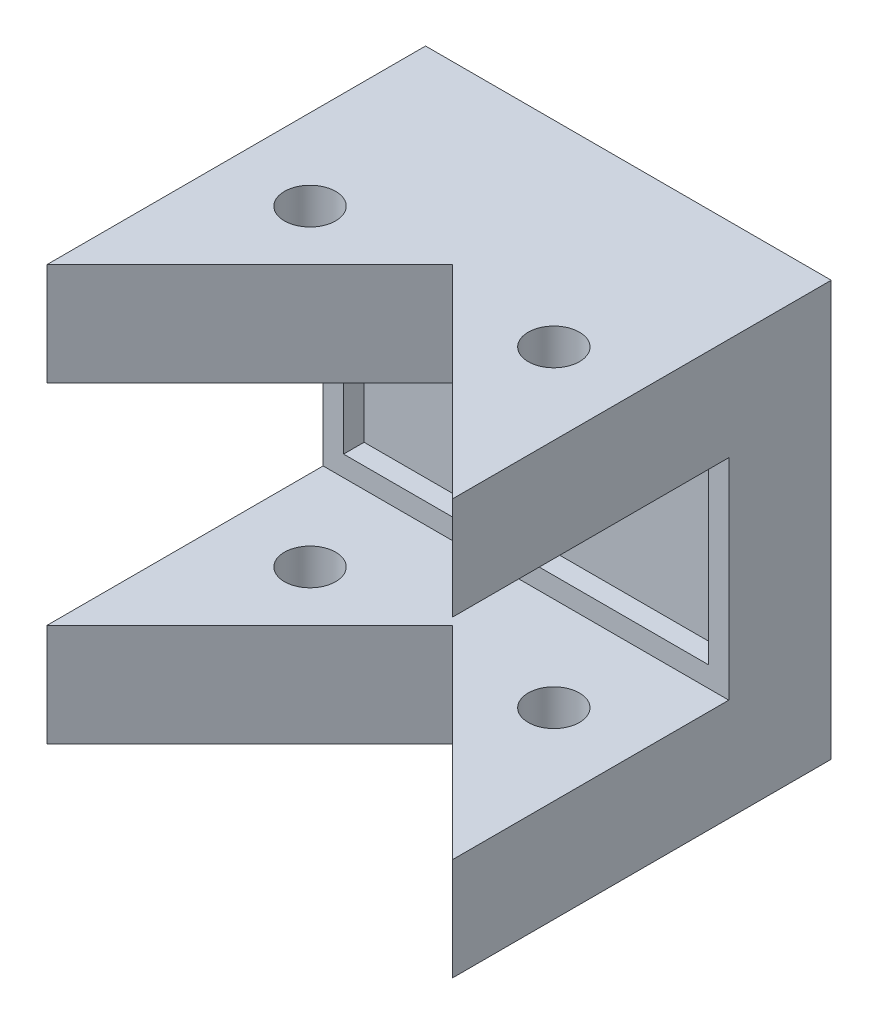
ISO-10303-21;
HEADER;
FILE_DESCRIPTION(('STEP AP214'),'2;1');
FILE_NAME('part.step','',(''),(''),'','','');
FILE_SCHEMA(('AUTOMOTIVE_DESIGN { 1 0 10303 214 1 1 1 1 }'));
ENDSEC;
DATA;
#1=APPLICATION_CONTEXT('core data for automotive mechanical design processes');
#2=APPLICATION_PROTOCOL_DEFINITION('international standard','automotive_design',2000,#1);
#3=PRODUCT_CONTEXT('',#1,'mechanical');
#4=PRODUCT('Part','Part','',(#3));
#5=PRODUCT_RELATED_PRODUCT_CATEGORY('part','',(#4));
#6=PRODUCT_DEFINITION_FORMATION('','',#4);
#7=PRODUCT_DEFINITION_CONTEXT('part definition',#1,'design');
#8=PRODUCT_DEFINITION('design','',#6,#7);
#9=PRODUCT_DEFINITION_SHAPE('','',#8);
#10=(LENGTH_UNIT() NAMED_UNIT(*) SI_UNIT(.MILLI.,.METRE.));
#11=(NAMED_UNIT(*) PLANE_ANGLE_UNIT() SI_UNIT($,.RADIAN.));
#12=(NAMED_UNIT(*) SI_UNIT($,.STERADIAN.) SOLID_ANGLE_UNIT());
#13=UNCERTAINTY_MEASURE_WITH_UNIT(LENGTH_MEASURE(1.E-05),#10,'distance_accuracy_value','');
#14=(GEOMETRIC_REPRESENTATION_CONTEXT(3) GLOBAL_UNCERTAINTY_ASSIGNED_CONTEXT((#13)) GLOBAL_UNIT_ASSIGNED_CONTEXT((#10,
#11,#12)) REPRESENTATION_CONTEXT('',''));
#15=CARTESIAN_POINT('',(0.,0.,0.));
#16=DIRECTION('',(0.,0.,1.));
#17=DIRECTION('',(1.,0.,0.));
#18=AXIS2_PLACEMENT_3D('',#15,#16,#17);
#19=CARTESIAN_POINT('',(0.,0.,5.));
#20=DIRECTION('',(0.,0.,-1.));
#21=DIRECTION('',(-1.,0.,0.));
#22=AXIS2_PLACEMENT_3D('',#19,#20,#21);
#23=PLANE('',#22);
#24=DIRECTION('',(1.,0.,0.));
#25=VECTOR('',#24,1.);
#26=CARTESIAN_POINT('',(2.,6.75,5.));
#27=LINE('',#26,#25);
#28=CARTESIAN_POINT('',(2.,6.75,5.));
#29=VERTEX_POINT('',#28);
#30=CARTESIAN_POINT('',(37.6,6.75,5.));
#31=VERTEX_POINT('',#30);
#32=EDGE_CURVE('E183',#29,#31,#27,.T.);
#33=ORIENTED_EDGE('',*,*,#32,.F.);
#34=DIRECTION('',(0.,-1.,0.));
#35=VECTOR('',#34,1.);
#36=CARTESIAN_POINT('',(2.,23.25,5.));
#37=LINE('',#36,#35);
#38=CARTESIAN_POINT('',(2.,23.25,5.));
#39=VERTEX_POINT('',#38);
#40=EDGE_CURVE('E59',#39,#29,#37,.T.);
#41=ORIENTED_EDGE('',*,*,#40,.F.);
#42=DIRECTION('',(-1.,0.,0.));
#43=VECTOR('',#42,1.);
#44=CARTESIAN_POINT('',(2.,23.25,5.));
#45=LINE('',#44,#43);
#46=CARTESIAN_POINT('',(37.6,23.25,5.));
#47=VERTEX_POINT('',#46);
#48=EDGE_CURVE('E167',#47,#39,#45,.T.);
#49=ORIENTED_EDGE('',*,*,#48,.F.);
#50=DIRECTION('',(0.,1.,0.));
#51=VECTOR('',#50,1.);
#52=CARTESIAN_POINT('',(37.6,23.25,5.));
#53=LINE('',#52,#51);
#54=EDGE_CURVE('E171',#31,#47,#53,.T.);
#55=ORIENTED_EDGE('',*,*,#54,.F.);
#56=EDGE_LOOP('',(#33,#41,#49,#55));
#57=FACE_BOUND('',#56,.T.);
#58=DIRECTION('',(-1.,0.,0.));
#59=VECTOR('',#58,1.);
#60=CARTESIAN_POINT('',(39.6,25.25,5.));
#61=LINE('',#60,#59);
#62=CARTESIAN_POINT('',(39.6,25.25,5.));
#63=VERTEX_POINT('',#62);
#64=CARTESIAN_POINT('',(0.,25.25,5.));
#65=VERTEX_POINT('',#64);
#66=EDGE_CURVE('E66',#63,#65,#61,.T.);
#67=ORIENTED_EDGE('',*,*,#66,.T.);
#68=DIRECTION('',(0.,-1.,0.));
#69=VECTOR('',#68,1.);
#70=CARTESIAN_POINT('',(0.,0.,5.));
#71=LINE('',#70,#69);
#72=CARTESIAN_POINT('',(0.,4.75,5.));
#73=VERTEX_POINT('',#72);
#74=EDGE_CURVE('E51',#65,#73,#71,.T.);
#75=ORIENTED_EDGE('',*,*,#74,.T.);
#76=DIRECTION('',(1.,0.,0.));
#77=VECTOR('',#76,1.);
#78=CARTESIAN_POINT('',(0.,4.75,5.));
#79=LINE('',#78,#77);
#80=CARTESIAN_POINT('',(39.6,4.75,5.));
#81=VERTEX_POINT('',#80);
#82=EDGE_CURVE('E252',#73,#81,#79,.T.);
#83=ORIENTED_EDGE('',*,*,#82,.T.);
#84=DIRECTION('',(0.,1.,0.));
#85=VECTOR('',#84,1.);
#86=CARTESIAN_POINT('',(39.6,0.,5.));
#87=LINE('',#86,#85);
#88=EDGE_CURVE('E11',#81,#63,#87,.T.);
#89=ORIENTED_EDGE('',*,*,#88,.T.);
#90=EDGE_LOOP('',(#67,#75,#83,#89));
#91=FACE_BOUND('',#90,.T.);
#92=ADVANCED_FACE('F41',(#57,#91),#23,.F.);
#93=CARTESIAN_POINT('',(0.,0.,5.));
#94=DIRECTION('',(1.,0.,0.));
#95=DIRECTION('',(0.,0.,-1.));
#96=AXIS2_PLACEMENT_3D('',#93,#94,#95);
#97=PLANE('',#96);
#98=DIRECTION('',(0.,0.,1.));
#99=VECTOR('',#98,1.);
#100=CARTESIAN_POINT('',(0.,35.25,5.));
#101=LINE('',#100,#99);
#102=CARTESIAN_POINT('',(0.,35.25,-5.));
#103=VERTEX_POINT('',#102);
#104=CARTESIAN_POINT('',(0.,35.25,31.975));
#105=VERTEX_POINT('',#104);
#106=EDGE_CURVE('E231',#103,#105,#101,.T.);
#107=ORIENTED_EDGE('',*,*,#106,.F.);
#108=DIRECTION('',(0.,1.,0.));
#109=VECTOR('',#108,1.);
#110=CARTESIAN_POINT('',(0.,35.25,-5.));
#111=LINE('',#110,#109);
#112=CARTESIAN_POINT('',(0.,-5.25,-5.));
#113=VERTEX_POINT('',#112);
#114=EDGE_CURVE('E205',#113,#103,#111,.T.);
#115=ORIENTED_EDGE('',*,*,#114,.F.);
#116=DIRECTION('',(0.,0.,-1.));
#117=VECTOR('',#116,1.);
#118=CARTESIAN_POINT('',(0.,-5.25,5.));
#119=LINE('',#118,#117);
#120=CARTESIAN_POINT('',(0.,-5.25,31.975));
#121=VERTEX_POINT('',#120);
#122=EDGE_CURVE('E281',#121,#113,#119,.T.);
#123=ORIENTED_EDGE('',*,*,#122,.F.);
#124=DIRECTION('',(0.,1.,0.));
#125=VECTOR('',#124,1.);
#126=CARTESIAN_POINT('',(0.,-5.25,31.975));
#127=LINE('',#126,#125);
#128=CARTESIAN_POINT('',(0.,4.75,31.975));
#129=VERTEX_POINT('',#128);
#130=EDGE_CURVE('E284',#121,#129,#127,.T.);
#131=ORIENTED_EDGE('',*,*,#130,.T.);
#132=DIRECTION('',(0.,0.,-1.));
#133=VECTOR('',#132,1.);
#134=CARTESIAN_POINT('',(0.,4.75,5.));
#135=LINE('',#134,#133);
#136=EDGE_CURVE('E268',#129,#73,#135,.T.);
#137=ORIENTED_EDGE('',*,*,#136,.T.);
#138=ORIENTED_EDGE('',*,*,#74,.F.);
#139=DIRECTION('',(0.,0.,1.));
#140=VECTOR('',#139,1.);
#141=CARTESIAN_POINT('',(0.,25.25,5.));
#142=LINE('',#141,#140);
#143=CARTESIAN_POINT('',(0.,25.25,31.975));
#144=VERTEX_POINT('',#143);
#145=EDGE_CURVE('E215',#65,#144,#142,.T.);
#146=ORIENTED_EDGE('',*,*,#145,.T.);
#147=DIRECTION('',(0.,-1.,0.));
#148=VECTOR('',#147,1.);
#149=CARTESIAN_POINT('',(0.,35.25,31.975));
#150=LINE('',#149,#148);
#151=EDGE_CURVE('E249',#105,#144,#150,.T.);
#152=ORIENTED_EDGE('',*,*,#151,.F.);
#153=EDGE_LOOP('',(#107,#115,#123,#131,#137,#138,#146,#152));
#154=FACE_BOUND('',#153,.T.);
#155=ADVANCED_FACE('F43',(#154),#97,.F.);
#156=CARTESIAN_POINT('',(39.6,0.,5.));
#157=DIRECTION('',(-1.,0.,0.));
#158=DIRECTION('',(0.,0.,1.));
#159=AXIS2_PLACEMENT_3D('',#156,#157,#158);
#160=PLANE('',#159);
#161=DIRECTION('',(0.,0.,1.));
#162=VECTOR('',#161,1.);
#163=CARTESIAN_POINT('',(39.6000000000001,-5.25,31.9770202535535));
#164=LINE('',#163,#162);
#165=CARTESIAN_POINT('',(39.6,-5.25,-5.));
#166=VERTEX_POINT('',#165);
#167=CARTESIAN_POINT('',(39.6000000000001,-5.25,31.9770202535535));
#168=VERTEX_POINT('',#167);
#169=EDGE_CURVE('E272',#166,#168,#164,.T.);
#170=ORIENTED_EDGE('',*,*,#169,.F.);
#171=DIRECTION('',(0.,-1.,0.));
#172=VECTOR('',#171,1.);
#173=CARTESIAN_POINT('',(39.6,35.25,-5.));
#174=LINE('',#173,#172);
#175=CARTESIAN_POINT('',(39.6,35.25,-5.));
#176=VERTEX_POINT('',#175);
#177=EDGE_CURVE('E192',#176,#166,#174,.T.);
#178=ORIENTED_EDGE('',*,*,#177,.F.);
#179=DIRECTION('',(0.,0.,-1.));
#180=VECTOR('',#179,1.);
#181=CARTESIAN_POINT('',(39.6000000000001,35.25,31.9770202535535));
#182=LINE('',#181,#180);
#183=CARTESIAN_POINT('',(39.6000000000001,35.25,31.9770202535535));
#184=VERTEX_POINT('',#183);
#185=EDGE_CURVE('E240',#184,#176,#182,.T.);
#186=ORIENTED_EDGE('',*,*,#185,.F.);
#187=DIRECTION('',(0.,-1.,0.));
#188=VECTOR('',#187,1.);
#189=CARTESIAN_POINT('',(39.6000000000001,35.25,31.9770202535535));
#190=LINE('',#189,#188);
#191=CARTESIAN_POINT('',(39.6000000000001,25.25,31.9770202535535));
#192=VERTEX_POINT('',#191);
#193=EDGE_CURVE('E243',#184,#192,#190,.T.);
#194=ORIENTED_EDGE('',*,*,#193,.T.);
#195=DIRECTION('',(0.,0.,-1.));
#196=VECTOR('',#195,1.);
#197=CARTESIAN_POINT('',(39.6000000000001,25.25,31.9770202535535));
#198=LINE('',#197,#196);
#199=EDGE_CURVE('E227',#192,#63,#198,.T.);
#200=ORIENTED_EDGE('',*,*,#199,.T.);
#201=ORIENTED_EDGE('',*,*,#88,.F.);
#202=DIRECTION('',(0.,0.,1.));
#203=VECTOR('',#202,1.);
#204=CARTESIAN_POINT('',(39.6000000000001,4.75,31.9770202535535));
#205=LINE('',#204,#203);
#206=CARTESIAN_POINT('',(39.6000000000001,4.75,31.9770202535535));
#207=VERTEX_POINT('',#206);
#208=EDGE_CURVE('E256',#81,#207,#205,.T.);
#209=ORIENTED_EDGE('',*,*,#208,.T.);
#210=DIRECTION('',(0.,1.,0.));
#211=VECTOR('',#210,1.);
#212=CARTESIAN_POINT('',(39.6000000000001,-5.25,31.9770202535535));
#213=LINE('',#212,#211);
#214=EDGE_CURVE('E290',#168,#207,#213,.T.);
#215=ORIENTED_EDGE('',*,*,#214,.F.);
#216=EDGE_LOOP('',(#170,#178,#186,#194,#200,#201,#209,#215));
#217=FACE_BOUND('',#216,.T.);
#218=ADVANCED_FACE('F348',(#217),#160,.F.);
#219=CARTESIAN_POINT('',(19.7989898732233,-5.25,12.1760101267767));
#220=DIRECTION('',(0.707106781186548,0.,-0.707106781186547));
#221=DIRECTION('',(-0.707106781186547,0.,-0.707106781186548));
#222=AXIS2_PLACEMENT_3D('',#219,#220,#221);
#223=PLANE('',#222);
#224=ORIENTED_EDGE('',*,*,#214,.T.);
#225=DIRECTION('',(-0.707106781186547,0.,-0.707106781186548));
#226=VECTOR('',#225,1.);
#227=CARTESIAN_POINT('',(19.7989898732233,4.75,12.1760101267767));
#228=LINE('',#227,#226);
#229=CARTESIAN_POINT('',(19.7989898732233,4.75,12.1760101267767));
#230=VERTEX_POINT('',#229);
#231=EDGE_CURVE('E260',#207,#230,#228,.T.);
#232=ORIENTED_EDGE('',*,*,#231,.T.);
#233=DIRECTION('',(0.,1.,0.));
#234=VECTOR('',#233,1.);
#235=CARTESIAN_POINT('',(19.7989898732233,-5.25,12.1760101267767));
#236=LINE('',#235,#234);
#237=CARTESIAN_POINT('',(19.7989898732233,-5.25,12.1760101267767));
#238=VERTEX_POINT('',#237);
#239=EDGE_CURVE('E287',#238,#230,#236,.T.);
#240=ORIENTED_EDGE('',*,*,#239,.F.);
#241=DIRECTION('',(-0.707106781186547,0.,-0.707106781186548));
#242=VECTOR('',#241,1.);
#243=CARTESIAN_POINT('',(19.7989898732233,-5.25,12.1760101267767));
#244=LINE('',#243,#242);
#245=EDGE_CURVE('E275',#168,#238,#244,.T.);
#246=ORIENTED_EDGE('',*,*,#245,.F.);
#247=EDGE_LOOP('',(#224,#232,#240,#246));
#248=FACE_BOUND('',#247,.T.);
#249=ADVANCED_FACE('F351',(#248),#223,.F.);
#250=CARTESIAN_POINT('',(0.,-5.25,31.975));
#251=DIRECTION('',(-0.707106781186547,0.,-0.707106781186548));
#252=DIRECTION('',(-0.707106781186548,0.,0.707106781186547));
#253=AXIS2_PLACEMENT_3D('',#250,#251,#252);
#254=PLANE('',#253);
#255=ORIENTED_EDGE('',*,*,#239,.T.);
#256=DIRECTION('',(-0.707106781186548,0.,0.707106781186547));
#257=VECTOR('',#256,1.);
#258=CARTESIAN_POINT('',(0.,4.75,31.975));
#259=LINE('',#258,#257);
#260=EDGE_CURVE('E264',#230,#129,#259,.T.);
#261=ORIENTED_EDGE('',*,*,#260,.T.);
#262=ORIENTED_EDGE('',*,*,#130,.F.);
#263=DIRECTION('',(-0.707106781186548,0.,0.707106781186547));
#264=VECTOR('',#263,1.);
#265=CARTESIAN_POINT('',(0.,-5.25,31.975));
#266=LINE('',#265,#264);
#267=EDGE_CURVE('E278',#238,#121,#266,.T.);
#268=ORIENTED_EDGE('',*,*,#267,.F.);
#269=EDGE_LOOP('',(#255,#261,#262,#268));
#270=FACE_BOUND('',#269,.T.);
#271=ADVANCED_FACE('F358',(#270),#254,.F.);
#272=CARTESIAN_POINT('',(0.,-5.25,0.));
#273=DIRECTION('',(0.,1.,0.));
#274=DIRECTION('',(0.,0.,1.));
#275=AXIS2_PLACEMENT_3D('',#272,#273,#274);
#276=PLANE('',#275);
#277=CARTESIAN_POINT('',(31.7,-5.25,14.1775253169417));
#278=DIRECTION('',(0.,-1.,0.));
#279=DIRECTION('',(0.,0.,-1.));
#280=AXIS2_PLACEMENT_3D('',#277,#278,#279);
#281=CIRCLE('',#280,2.49999999999999);
#282=CARTESIAN_POINT('',(31.7,-5.25,11.6775253169417));
#283=VERTEX_POINT('',#282);
#284=EDGE_CURVE('E317',#283,#283,#281,.T.);
#285=ORIENTED_EDGE('',*,*,#284,.F.);
#286=EDGE_LOOP('',(#285));
#287=FACE_BOUND('',#286,.T.);
#288=CARTESIAN_POINT('',(7.9,-5.25,14.1755050633883));
#289=DIRECTION('',(0.,-1.,0.));
#290=DIRECTION('',(0.,0.,-1.));
#291=AXIS2_PLACEMENT_3D('',#288,#289,#290);
#292=CIRCLE('',#291,2.5);
#293=CARTESIAN_POINT('',(7.9,-5.25,11.6755050633883));
#294=VERTEX_POINT('',#293);
#295=EDGE_CURVE('E298',#294,#294,#292,.T.);
#296=ORIENTED_EDGE('',*,*,#295,.F.);
#297=EDGE_LOOP('',(#296));
#298=FACE_BOUND('',#297,.T.);
#299=ORIENTED_EDGE('',*,*,#122,.T.);
#300=DIRECTION('',(-1.,0.,0.));
#301=VECTOR('',#300,1.);
#302=CARTESIAN_POINT('',(39.6,-5.25,-5.));
#303=LINE('',#302,#301);
#304=EDGE_CURVE('E201',#166,#113,#303,.T.);
#305=ORIENTED_EDGE('',*,*,#304,.F.);
#306=ORIENTED_EDGE('',*,*,#169,.T.);
#307=ORIENTED_EDGE('',*,*,#245,.T.);
#308=ORIENTED_EDGE('',*,*,#267,.T.);
#309=EDGE_LOOP('',(#299,#305,#306,#307,#308));
#310=FACE_BOUND('',#309,.T.);
#311=ADVANCED_FACE('F366',(#287,#298,#310),#276,.F.);
#312=CARTESIAN_POINT('',(0.,4.75,0.));
#313=DIRECTION('',(0.,1.,0.));
#314=DIRECTION('',(0.,0.,1.));
#315=AXIS2_PLACEMENT_3D('',#312,#313,#314);
#316=PLANE('',#315);
#317=CARTESIAN_POINT('',(31.7,4.75,14.1775253169417));
#318=DIRECTION('',(0.,1.,0.));
#319=DIRECTION('',(0.,0.,1.));
#320=AXIS2_PLACEMENT_3D('',#317,#318,#319);
#321=CIRCLE('',#320,2.49999999999999);
#322=CARTESIAN_POINT('',(31.7,4.74999999999999,11.6775253169417));
#323=VERTEX_POINT('',#322);
#324=EDGE_CURVE('E305',#323,#323,#321,.T.);
#325=ORIENTED_EDGE('',*,*,#324,.F.);
#326=EDGE_LOOP('',(#325));
#327=FACE_BOUND('',#326,.T.);
#328=CARTESIAN_POINT('',(7.9,4.75,14.1755050633883));
#329=DIRECTION('',(0.,1.,0.));
#330=DIRECTION('',(0.,0.,1.));
#331=AXIS2_PLACEMENT_3D('',#328,#329,#330);
#332=CIRCLE('',#331,2.5);
#333=CARTESIAN_POINT('',(7.9,4.74999999999999,11.6755050633883));
#334=VERTEX_POINT('',#333);
#335=EDGE_CURVE('E174',#334,#334,#332,.T.);
#336=ORIENTED_EDGE('',*,*,#335,.F.);
#337=EDGE_LOOP('',(#336));
#338=FACE_BOUND('',#337,.T.);
#339=ORIENTED_EDGE('',*,*,#82,.F.);
#340=ORIENTED_EDGE('',*,*,#136,.F.);
#341=ORIENTED_EDGE('',*,*,#260,.F.);
#342=ORIENTED_EDGE('',*,*,#231,.F.);
#343=ORIENTED_EDGE('',*,*,#208,.F.);
#344=EDGE_LOOP('',(#339,#340,#341,#342,#343));
#345=FACE_BOUND('',#344,.T.);
#346=ADVANCED_FACE('F390',(#327,#338,#345),#316,.T.);
#347=CARTESIAN_POINT('',(0.,35.25,31.975));
#348=DIRECTION('',(-0.707106781186547,0.,-0.707106781186548));
#349=DIRECTION('',(-0.707106781186548,0.,0.707106781186547));
#350=AXIS2_PLACEMENT_3D('',#347,#348,#349);
#351=PLANE('',#350);
#352=ORIENTED_EDGE('',*,*,#151,.T.);
#353=DIRECTION('',(0.707106781186548,0.,-0.707106781186547));
#354=VECTOR('',#353,1.);
#355=CARTESIAN_POINT('',(0.,25.25,31.975));
#356=LINE('',#355,#354);
#357=CARTESIAN_POINT('',(19.7989898732233,25.25,12.1760101267767));
#358=VERTEX_POINT('',#357);
#359=EDGE_CURVE('E219',#144,#358,#356,.T.);
#360=ORIENTED_EDGE('',*,*,#359,.T.);
#361=DIRECTION('',(0.,-1.,0.));
#362=VECTOR('',#361,1.);
#363=CARTESIAN_POINT('',(19.7989898732233,35.25,12.1760101267767));
#364=LINE('',#363,#362);
#365=CARTESIAN_POINT('',(19.7989898732233,35.25,12.1760101267767));
#366=VERTEX_POINT('',#365);
#367=EDGE_CURVE('E246',#366,#358,#364,.T.);
#368=ORIENTED_EDGE('',*,*,#367,.F.);
#369=DIRECTION('',(0.707106781186548,0.,-0.707106781186547));
#370=VECTOR('',#369,1.);
#371=CARTESIAN_POINT('',(0.,35.25,31.975));
#372=LINE('',#371,#370);
#373=EDGE_CURVE('E234',#105,#366,#372,.T.);
#374=ORIENTED_EDGE('',*,*,#373,.F.);
#375=EDGE_LOOP('',(#352,#360,#368,#374));
#376=FACE_BOUND('',#375,.T.);
#377=ADVANCED_FACE('F406',(#376),#351,.F.);
#378=CARTESIAN_POINT('',(19.7989898732233,35.25,12.1760101267767));
#379=DIRECTION('',(0.707106781186548,0.,-0.707106781186547));
#380=DIRECTION('',(-0.707106781186547,0.,-0.707106781186548));
#381=AXIS2_PLACEMENT_3D('',#378,#379,#380);
#382=PLANE('',#381);
#383=ORIENTED_EDGE('',*,*,#367,.T.);
#384=DIRECTION('',(0.707106781186547,0.,0.707106781186548));
#385=VECTOR('',#384,1.);
#386=CARTESIAN_POINT('',(19.7989898732233,25.25,12.1760101267767));
#387=LINE('',#386,#385);
#388=EDGE_CURVE('E223',#358,#192,#387,.T.);
#389=ORIENTED_EDGE('',*,*,#388,.T.);
#390=ORIENTED_EDGE('',*,*,#193,.F.);
#391=DIRECTION('',(0.707106781186547,0.,0.707106781186548));
#392=VECTOR('',#391,1.);
#393=CARTESIAN_POINT('',(19.7989898732233,35.25,12.1760101267767));
#394=LINE('',#393,#392);
#395=EDGE_CURVE('E237',#366,#184,#394,.T.);
#396=ORIENTED_EDGE('',*,*,#395,.F.);
#397=EDGE_LOOP('',(#383,#389,#390,#396));
#398=FACE_BOUND('',#397,.T.);
#399=ADVANCED_FACE('F381',(#398),#382,.F.);
#400=CARTESIAN_POINT('',(0.,35.25,0.));
#401=DIRECTION('',(0.,1.,0.));
#402=DIRECTION('',(0.,0.,1.));
#403=AXIS2_PLACEMENT_3D('',#400,#401,#402);
#404=PLANE('',#403);
#405=CARTESIAN_POINT('',(31.7,35.25,14.1775253169417));
#406=DIRECTION('',(0.,1.,0.));
#407=DIRECTION('',(0.,0.,1.));
#408=AXIS2_PLACEMENT_3D('',#405,#406,#407);
#409=CIRCLE('',#408,2.49999999999999);
#410=CARTESIAN_POINT('',(31.7,35.25,11.6775253169417));
#411=VERTEX_POINT('',#410);
#412=EDGE_CURVE('E311',#411,#411,#409,.T.);
#413=ORIENTED_EDGE('',*,*,#412,.F.);
#414=EDGE_LOOP('',(#413));
#415=FACE_BOUND('',#414,.T.);
#416=CARTESIAN_POINT('',(7.9,35.25,14.1755050633883));
#417=DIRECTION('',(0.,1.,0.));
#418=DIRECTION('',(0.,0.,1.));
#419=AXIS2_PLACEMENT_3D('',#416,#417,#418);
#420=CIRCLE('',#419,2.5);
#421=CARTESIAN_POINT('',(7.9,35.25,11.6755050633883));
#422=VERTEX_POINT('',#421);
#423=EDGE_CURVE('E297',#422,#422,#420,.T.);
#424=ORIENTED_EDGE('',*,*,#423,.F.);
#425=EDGE_LOOP('',(#424));
#426=FACE_BOUND('',#425,.T.);
#427=ORIENTED_EDGE('',*,*,#185,.T.);
#428=DIRECTION('',(1.,0.,0.));
#429=VECTOR('',#428,1.);
#430=CARTESIAN_POINT('',(39.6,35.25,-5.));
#431=LINE('',#430,#429);
#432=EDGE_CURVE('E209',#103,#176,#431,.T.);
#433=ORIENTED_EDGE('',*,*,#432,.F.);
#434=ORIENTED_EDGE('',*,*,#106,.T.);
#435=ORIENTED_EDGE('',*,*,#373,.T.);
#436=ORIENTED_EDGE('',*,*,#395,.T.);
#437=EDGE_LOOP('',(#427,#433,#434,#435,#436));
#438=FACE_BOUND('',#437,.T.);
#439=ADVANCED_FACE('F373',(#415,#426,#438),#404,.T.);
#440=CARTESIAN_POINT('',(0.,25.25,0.));
#441=DIRECTION('',(0.,1.,0.));
#442=DIRECTION('',(0.,0.,1.));
#443=AXIS2_PLACEMENT_3D('',#440,#441,#442);
#444=PLANE('',#443);
#445=CARTESIAN_POINT('',(31.7,25.25,14.1775253169417));
#446=DIRECTION('',(0.,1.,0.));
#447=DIRECTION('',(0.,0.,1.));
#448=AXIS2_PLACEMENT_3D('',#445,#446,#447);
#449=CIRCLE('',#448,2.49999999999999);
#450=CARTESIAN_POINT('',(31.7,25.25,11.6775253169417));
#451=VERTEX_POINT('',#450);
#452=EDGE_CURVE('E45',#451,#451,#449,.T.);
#453=ORIENTED_EDGE('',*,*,#452,.T.);
#454=EDGE_LOOP('',(#453));
#455=FACE_BOUND('',#454,.T.);
#456=CARTESIAN_POINT('',(7.9,25.25,14.1755050633883));
#457=DIRECTION('',(0.,1.,0.));
#458=DIRECTION('',(0.,0.,1.));
#459=AXIS2_PLACEMENT_3D('',#456,#457,#458);
#460=CIRCLE('',#459,2.5);
#461=CARTESIAN_POINT('',(7.9,25.25,11.6755050633883));
#462=VERTEX_POINT('',#461);
#463=EDGE_CURVE('E294',#462,#462,#460,.T.);
#464=ORIENTED_EDGE('',*,*,#463,.T.);
#465=EDGE_LOOP('',(#464));
#466=FACE_BOUND('',#465,.T.);
#467=ORIENTED_EDGE('',*,*,#66,.F.);
#468=ORIENTED_EDGE('',*,*,#199,.F.);
#469=ORIENTED_EDGE('',*,*,#388,.F.);
#470=ORIENTED_EDGE('',*,*,#359,.F.);
#471=ORIENTED_EDGE('',*,*,#145,.F.);
#472=EDGE_LOOP('',(#467,#468,#469,#470,#471));
#473=FACE_BOUND('',#472,.T.);
#474=ADVANCED_FACE('F326',(#455,#466,#473),#444,.F.);
#475=CARTESIAN_POINT('',(0.,0.,-5.));
#476=DIRECTION('',(0.,0.,-1.));
#477=DIRECTION('',(-1.,0.,0.));
#478=AXIS2_PLACEMENT_3D('',#475,#476,#477);
#479=PLANE('',#478);
#480=ORIENTED_EDGE('',*,*,#177,.T.);
#481=ORIENTED_EDGE('',*,*,#304,.T.);
#482=ORIENTED_EDGE('',*,*,#114,.T.);
#483=ORIENTED_EDGE('',*,*,#432,.T.);
#484=EDGE_LOOP('',(#480,#481,#482,#483));
#485=FACE_BOUND('',#484,.T.);
#486=ADVANCED_FACE('F370',(#485),#479,.T.);
#487=CARTESIAN_POINT('',(2.,23.25,3.));
#488=DIRECTION('',(-1.,0.,0.));
#489=DIRECTION('',(0.,-1.,0.));
#490=AXIS2_PLACEMENT_3D('',#487,#488,#489);
#491=PLANE('',#490);
#492=ORIENTED_EDGE('',*,*,#40,.T.);
#493=DIRECTION('',(0.,0.,1.));
#494=VECTOR('',#493,1.);
#495=CARTESIAN_POINT('',(2.,6.75,3.));
#496=LINE('',#495,#494);
#497=CARTESIAN_POINT('',(2.,6.75,3.));
#498=VERTEX_POINT('',#497);
#499=EDGE_CURVE('E142',#498,#29,#496,.T.);
#500=ORIENTED_EDGE('',*,*,#499,.F.);
#501=DIRECTION('',(0.,-1.,0.));
#502=VECTOR('',#501,1.);
#503=CARTESIAN_POINT('',(2.,23.25,3.));
#504=LINE('',#503,#502);
#505=CARTESIAN_POINT('',(2.,23.25,3.));
#506=VERTEX_POINT('',#505);
#507=EDGE_CURVE('E146',#506,#498,#504,.T.);
#508=ORIENTED_EDGE('',*,*,#507,.F.);
#509=DIRECTION('',(0.,0.,1.));
#510=VECTOR('',#509,1.);
#511=CARTESIAN_POINT('',(2.,23.25,3.));
#512=LINE('',#511,#510);
#513=EDGE_CURVE('E189',#506,#39,#512,.T.);
#514=ORIENTED_EDGE('',*,*,#513,.T.);
#515=EDGE_LOOP('',(#492,#500,#508,#514));
#516=FACE_BOUND('',#515,.T.);
#517=ADVANCED_FACE('F144',(#516),#491,.F.);
#518=CARTESIAN_POINT('',(2.,23.25,3.));
#519=DIRECTION('',(0.,1.,0.));
#520=DIRECTION('',(0.,0.,1.));
#521=AXIS2_PLACEMENT_3D('',#518,#519,#520);
#522=PLANE('',#521);
#523=ORIENTED_EDGE('',*,*,#48,.T.);
#524=ORIENTED_EDGE('',*,*,#513,.F.);
#525=DIRECTION('',(-1.,0.,0.));
#526=VECTOR('',#525,1.);
#527=CARTESIAN_POINT('',(2.,23.25,3.));
#528=LINE('',#527,#526);
#529=CARTESIAN_POINT('',(37.6,23.25,3.));
#530=VERTEX_POINT('',#529);
#531=EDGE_CURVE('E153',#530,#506,#528,.T.);
#532=ORIENTED_EDGE('',*,*,#531,.F.);
#533=DIRECTION('',(0.,0.,1.));
#534=VECTOR('',#533,1.);
#535=CARTESIAN_POINT('',(37.6,23.25,3.));
#536=LINE('',#535,#534);
#537=EDGE_CURVE('E193',#530,#47,#536,.T.);
#538=ORIENTED_EDGE('',*,*,#537,.T.);
#539=EDGE_LOOP('',(#523,#524,#532,#538));
#540=FACE_BOUND('',#539,.T.);
#541=ADVANCED_FACE('F422',(#540),#522,.F.);
#542=CARTESIAN_POINT('',(37.6,23.25,3.));
#543=DIRECTION('',(1.,0.,0.));
#544=DIRECTION('',(0.,0.,-1.));
#545=AXIS2_PLACEMENT_3D('',#542,#543,#544);
#546=PLANE('',#545);
#547=ORIENTED_EDGE('',*,*,#54,.T.);
#548=ORIENTED_EDGE('',*,*,#537,.F.);
#549=DIRECTION('',(0.,1.,0.));
#550=VECTOR('',#549,1.);
#551=CARTESIAN_POINT('',(37.6,23.25,3.));
#552=LINE('',#551,#550);
#553=CARTESIAN_POINT('',(37.6,6.75,3.));
#554=VERTEX_POINT('',#553);
#555=EDGE_CURVE('E162',#554,#530,#552,.T.);
#556=ORIENTED_EDGE('',*,*,#555,.F.);
#557=DIRECTION('',(0.,0.,1.));
#558=VECTOR('',#557,1.);
#559=CARTESIAN_POINT('',(37.6,6.75,3.));
#560=LINE('',#559,#558);
#561=EDGE_CURVE('E152',#554,#31,#560,.T.);
#562=ORIENTED_EDGE('',*,*,#561,.T.);
#563=EDGE_LOOP('',(#547,#548,#556,#562));
#564=FACE_BOUND('',#563,.T.);
#565=ADVANCED_FACE('F425',(#564),#546,.F.);
#566=CARTESIAN_POINT('',(2.,6.75,3.));
#567=DIRECTION('',(0.,-1.,0.));
#568=DIRECTION('',(0.,0.,-1.));
#569=AXIS2_PLACEMENT_3D('',#566,#567,#568);
#570=PLANE('',#569);
#571=ORIENTED_EDGE('',*,*,#32,.T.);
#572=ORIENTED_EDGE('',*,*,#561,.F.);
#573=DIRECTION('',(1.,0.,0.));
#574=VECTOR('',#573,1.);
#575=CARTESIAN_POINT('',(2.,6.75,3.));
#576=LINE('',#575,#574);
#577=EDGE_CURVE('E156',#498,#554,#576,.T.);
#578=ORIENTED_EDGE('',*,*,#577,.F.);
#579=ORIENTED_EDGE('',*,*,#499,.T.);
#580=EDGE_LOOP('',(#571,#572,#578,#579));
#581=FACE_BOUND('',#580,.T.);
#582=ADVANCED_FACE('F157',(#581),#570,.F.);
#583=CARTESIAN_POINT('',(0.,0.,3.));
#584=DIRECTION('',(0.,0.,1.));
#585=DIRECTION('',(1.,0.,0.));
#586=AXIS2_PLACEMENT_3D('',#583,#584,#585);
#587=PLANE('',#586);
#588=ORIENTED_EDGE('',*,*,#507,.T.);
#589=ORIENTED_EDGE('',*,*,#577,.T.);
#590=ORIENTED_EDGE('',*,*,#555,.T.);
#591=ORIENTED_EDGE('',*,*,#531,.T.);
#592=EDGE_LOOP('',(#588,#589,#590,#591));
#593=FACE_BOUND('',#592,.T.);
#594=ADVANCED_FACE('F164',(#593),#587,.T.);
#595=CARTESIAN_POINT('',(7.9,39.75,14.1755050633883));
#596=DIRECTION('',(0.,-1.,0.));
#597=DIRECTION('',(0.,0.,-1.));
#598=AXIS2_PLACEMENT_3D('',#595,#596,#597);
#599=CYLINDRICAL_SURFACE('',#598,2.5);
#600=CARTESIAN_POINT('',(7.9,35.25,11.6755050633883));
#601=CARTESIAN_POINT('',(7.9,35.1458333333333,11.6755050633883));
#602=CARTESIAN_POINT('',(7.9,35.0416666666667,11.6755050633883));
#603=CARTESIAN_POINT('',(7.9,34.8333333333333,11.6755050633883));
#604=CARTESIAN_POINT('',(7.9,34.7291666666667,11.6755050633883));
#605=CARTESIAN_POINT('',(7.9,34.5208333333333,11.6755050633883));
#606=CARTESIAN_POINT('',(7.9,34.4166666666667,11.6755050633883));
#607=CARTESIAN_POINT('',(7.9,34.2083333333333,11.6755050633883));
#608=CARTESIAN_POINT('',(7.9,34.1041666666667,11.6755050633883));
#609=CARTESIAN_POINT('',(7.9,33.8958333333333,11.6755050633883));
#610=CARTESIAN_POINT('',(7.9,33.7916666666667,11.6755050633883));
#611=CARTESIAN_POINT('',(7.9,33.5833333333333,11.6755050633883));
#612=CARTESIAN_POINT('',(7.9,33.4791666666667,11.6755050633883));
#613=CARTESIAN_POINT('',(7.9,33.2708333333333,11.6755050633883));
#614=CARTESIAN_POINT('',(7.9,33.1666666666667,11.6755050633883));
#615=CARTESIAN_POINT('',(7.9,32.9583333333333,11.6755050633883));
#616=CARTESIAN_POINT('',(7.9,32.8541666666667,11.6755050633883));
#617=CARTESIAN_POINT('',(7.9,32.6458333333333,11.6755050633883));
#618=CARTESIAN_POINT('',(7.9,32.5416666666667,11.6755050633883));
#619=CARTESIAN_POINT('',(7.9,32.3333333333333,11.6755050633883));
#620=CARTESIAN_POINT('',(7.9,32.2291666666667,11.6755050633883));
#621=CARTESIAN_POINT('',(7.9,32.0208333333333,11.6755050633883));
#622=CARTESIAN_POINT('',(7.9,31.9166666666667,11.6755050633883));
#623=CARTESIAN_POINT('',(7.9,31.7083333333333,11.6755050633883));
#624=CARTESIAN_POINT('',(7.9,31.6041666666667,11.6755050633883));
#625=CARTESIAN_POINT('',(7.9,31.3958333333333,11.6755050633883));
#626=CARTESIAN_POINT('',(7.9,31.2916666666667,11.6755050633883));
#627=CARTESIAN_POINT('',(7.9,31.0833333333333,11.6755050633883));
#628=CARTESIAN_POINT('',(7.9,30.9791666666667,11.6755050633883));
#629=CARTESIAN_POINT('',(7.9,30.7708333333333,11.6755050633883));
#630=CARTESIAN_POINT('',(7.9,30.6666666666667,11.6755050633883));
#631=CARTESIAN_POINT('',(7.9,30.4583333333333,11.6755050633883));
#632=CARTESIAN_POINT('',(7.9,30.3541666666667,11.6755050633883));
#633=CARTESIAN_POINT('',(7.9,30.1458333333333,11.6755050633883));
#634=CARTESIAN_POINT('',(7.9,30.0416666666667,11.6755050633883));
#635=CARTESIAN_POINT('',(7.9,29.8333333333333,11.6755050633883));
#636=CARTESIAN_POINT('',(7.9,29.7291666666667,11.6755050633883));
#637=CARTESIAN_POINT('',(7.9,29.5208333333333,11.6755050633883));
#638=CARTESIAN_POINT('',(7.9,29.4166666666667,11.6755050633883));
#639=CARTESIAN_POINT('',(7.9,29.2083333333333,11.6755050633883));
#640=CARTESIAN_POINT('',(7.9,29.1041666666667,11.6755050633883));
#641=CARTESIAN_POINT('',(7.9,28.8958333333333,11.6755050633883));
#642=CARTESIAN_POINT('',(7.9,28.7916666666667,11.6755050633883));
#643=CARTESIAN_POINT('',(7.9,28.5833333333333,11.6755050633883));
#644=CARTESIAN_POINT('',(7.9,28.4791666666667,11.6755050633883));
#645=CARTESIAN_POINT('',(7.9,28.2708333333333,11.6755050633883));
#646=CARTESIAN_POINT('',(7.9,28.1666666666667,11.6755050633883));
#647=CARTESIAN_POINT('',(7.9,27.9583333333333,11.6755050633883));
#648=CARTESIAN_POINT('',(7.9,27.8541666666667,11.6755050633883));
#649=CARTESIAN_POINT('',(7.9,27.6458333333333,11.6755050633883));
#650=CARTESIAN_POINT('',(7.9,27.5416666666667,11.6755050633883));
#651=CARTESIAN_POINT('',(7.9,27.3333333333333,11.6755050633883));
#652=CARTESIAN_POINT('',(7.9,27.2291666666667,11.6755050633883));
#653=CARTESIAN_POINT('',(7.9,27.0208333333333,11.6755050633883));
#654=CARTESIAN_POINT('',(7.9,26.9166666666667,11.6755050633883));
#655=CARTESIAN_POINT('',(7.9,26.7083333333333,11.6755050633883));
#656=CARTESIAN_POINT('',(7.9,26.6041666666667,11.6755050633883));
#657=CARTESIAN_POINT('',(7.9,26.3958333333333,11.6755050633883));
#658=CARTESIAN_POINT('',(7.9,26.2916666666667,11.6755050633883));
#659=CARTESIAN_POINT('',(7.9,26.0833333333333,11.6755050633883));
#660=CARTESIAN_POINT('',(7.9,25.9791666666667,11.6755050633883));
#661=CARTESIAN_POINT('',(7.9,25.7708333333333,11.6755050633883));
#662=CARTESIAN_POINT('',(7.9,25.6666666666667,11.6755050633883));
#663=CARTESIAN_POINT('',(7.9,25.4583333333333,11.6755050633883));
#664=CARTESIAN_POINT('',(7.9,25.3541666666667,11.6755050633883));
#665=CARTESIAN_POINT('',(7.9,25.25,11.6755050633883));
#666=B_SPLINE_CURVE_WITH_KNOTS('',3,(#600,#601,#602,#603,#604,#605,#606,#607,#608,#609,#610,
#611,#612,#613,#614,#615,#616,#617,#618,#619,#620,#621,#622,#623,#624,#625,#626,#627,#628,#629,
#630,#631,#632,#633,#634,#635,#636,#637,#638,#639,#640,#641,#642,#643,#644,#645,#646,#647,#648,
#649,#650,#651,#652,#653,#654,#655,#656,#657,#658,#659,#660,#661,#662,#663,#664,#665),
.UNSPECIFIED.,.F.,.F.,(4,2,2,2,2,2,2,2,2,2,2,2,2,2,2,2,2,2,2,2,2,2,2,2,2,2,2,2,2,2,2,2,4),(0.,
0.3125,0.625000000000001,0.937500000000001,1.25,1.5625,1.875,2.1875,2.5,2.8125,3.125,3.4375,
3.75,4.0625,4.375,4.6875,5.,5.3125,5.625,5.9375,6.25,6.5625,6.875,7.1875,7.5,7.8125,8.125,
8.4375,8.75,9.0625,9.375,9.6875,10.),.UNSPECIFIED.);
#667=EDGE_CURVE('BSEAM339',#422,#462,#666,.T.);
#668=ORIENTED_EDGE('',*,*,#423,.T.);
#669=ORIENTED_EDGE('',*,*,#463,.F.);
#670=ORIENTED_EDGE('',*,*,#667,.T.);
#671=ORIENTED_EDGE('',*,*,#667,.F.);
#672=EDGE_LOOP('',(#668,#670,#669,#671));
#673=FACE_BOUND('',#672,.T.);
#674=ADVANCED_FACE('F339',(#673),#599,.F.);
#675=CARTESIAN_POINT('',(7.9,4.74999999999999,11.6755050633883));
#676=CARTESIAN_POINT('',(7.9,4.64583333333332,11.6755050633883));
#677=CARTESIAN_POINT('',(7.9,4.54166666666666,11.6755050633883));
#678=CARTESIAN_POINT('',(7.9,4.33333333333332,11.6755050633883));
#679=CARTESIAN_POINT('',(7.9,4.22916666666666,11.6755050633883));
#680=CARTESIAN_POINT('',(7.9,4.02083333333332,11.6755050633883));
#681=CARTESIAN_POINT('',(7.9,3.91666666666666,11.6755050633883));
#682=CARTESIAN_POINT('',(7.9,3.70833333333332,11.6755050633883));
#683=CARTESIAN_POINT('',(7.9,3.60416666666666,11.6755050633883));
#684=CARTESIAN_POINT('',(7.9,3.39583333333332,11.6755050633883));
#685=CARTESIAN_POINT('',(7.9,3.29166666666666,11.6755050633883));
#686=CARTESIAN_POINT('',(7.9,3.08333333333332,11.6755050633883));
#687=CARTESIAN_POINT('',(7.9,2.97916666666666,11.6755050633883));
#688=CARTESIAN_POINT('',(7.9,2.77083333333332,11.6755050633883));
#689=CARTESIAN_POINT('',(7.9,2.66666666666666,11.6755050633883));
#690=CARTESIAN_POINT('',(7.9,2.45833333333332,11.6755050633883));
#691=CARTESIAN_POINT('',(7.9,2.35416666666665,11.6755050633883));
#692=CARTESIAN_POINT('',(7.9,2.14583333333332,11.6755050633883));
#693=CARTESIAN_POINT('',(7.9,2.04166666666666,11.6755050633883));
#694=CARTESIAN_POINT('',(7.9,1.83333333333333,11.6755050633883));
#695=CARTESIAN_POINT('',(7.9,1.72916666666666,11.6755050633883));
#696=CARTESIAN_POINT('',(7.9,1.52083333333333,11.6755050633883));
#697=CARTESIAN_POINT('',(7.9,1.41666666666666,11.6755050633883));
#698=CARTESIAN_POINT('',(7.9,1.20833333333333,11.6755050633883));
#699=CARTESIAN_POINT('',(7.9,1.10416666666666,11.6755050633883));
#700=CARTESIAN_POINT('',(7.9,0.895833333333327,11.6755050633883));
#701=CARTESIAN_POINT('',(7.9,0.79166666666666,11.6755050633883));
#702=CARTESIAN_POINT('',(7.9,0.583333333333327,11.6755050633883));
#703=CARTESIAN_POINT('',(7.9,0.47916666666666,11.6755050633883));
#704=CARTESIAN_POINT('',(7.9,0.270833333333327,11.6755050633883));
#705=CARTESIAN_POINT('',(7.9,0.16666666666666,11.6755050633883));
#706=CARTESIAN_POINT('',(7.9,-0.0416666666666736,11.6755050633883));
#707=CARTESIAN_POINT('',(7.9,-0.14583333333334,11.6755050633883));
#708=CARTESIAN_POINT('',(7.9,-0.354166666666674,11.6755050633883));
#709=CARTESIAN_POINT('',(7.9,-0.458333333333341,11.6755050633883));
#710=CARTESIAN_POINT('',(7.9,-0.666666666666674,11.6755050633883));
#711=CARTESIAN_POINT('',(7.9,-0.770833333333341,11.6755050633883));
#712=CARTESIAN_POINT('',(7.9,-0.979166666666674,11.6755050633883));
#713=CARTESIAN_POINT('',(7.9,-1.08333333333334,11.6755050633883));
#714=CARTESIAN_POINT('',(7.9,-1.29166666666667,11.6755050633883));
#715=CARTESIAN_POINT('',(7.9,-1.39583333333334,11.6755050633883));
#716=CARTESIAN_POINT('',(7.9,-1.60416666666667,11.6755050633883));
#717=CARTESIAN_POINT('',(7.9,-1.70833333333334,11.6755050633883));
#718=CARTESIAN_POINT('',(7.9,-1.91666666666668,11.6755050633883));
#719=CARTESIAN_POINT('',(7.9,-2.02083333333334,11.6755050633883));
#720=CARTESIAN_POINT('',(7.9,-2.22916666666668,11.6755050633883));
#721=CARTESIAN_POINT('',(7.9,-2.33333333333334,11.6755050633883));
#722=CARTESIAN_POINT('',(7.9,-2.54166666666667,11.6755050633883));
#723=CARTESIAN_POINT('',(7.9,-2.64583333333334,11.6755050633883));
#724=CARTESIAN_POINT('',(7.9,-2.85416666666667,11.6755050633883));
#725=CARTESIAN_POINT('',(7.9,-2.95833333333334,11.6755050633883));
#726=CARTESIAN_POINT('',(7.9,-3.16666666666667,11.6755050633883));
#727=CARTESIAN_POINT('',(7.9,-3.27083333333334,11.6755050633883));
#728=CARTESIAN_POINT('',(7.9,-3.47916666666667,11.6755050633883));
#729=CARTESIAN_POINT('',(7.9,-3.58333333333334,11.6755050633883));
#730=CARTESIAN_POINT('',(7.9,-3.79166666666667,11.6755050633883));
#731=CARTESIAN_POINT('',(7.9,-3.89583333333334,11.6755050633883));
#732=CARTESIAN_POINT('',(7.9,-4.10416666666667,11.6755050633883));
#733=CARTESIAN_POINT('',(7.9,-4.20833333333334,11.6755050633883));
#734=CARTESIAN_POINT('',(7.9,-4.41666666666667,11.6755050633883));
#735=CARTESIAN_POINT('',(7.9,-4.52083333333334,11.6755050633883));
#736=CARTESIAN_POINT('',(7.9,-4.72916666666667,11.6755050633883));
#737=CARTESIAN_POINT('',(7.9,-4.83333333333334,11.6755050633883));
#738=CARTESIAN_POINT('',(7.9,-5.04166666666667,11.6755050633883));
#739=CARTESIAN_POINT('',(7.9,-5.14583333333334,11.6755050633883));
#740=CARTESIAN_POINT('',(7.9,-5.25,11.6755050633883));
#741=B_SPLINE_CURVE_WITH_KNOTS('',3,(#675,#676,#677,#678,#679,#680,#681,#682,#683,#684,#685,
#686,#687,#688,#689,#690,#691,#692,#693,#694,#695,#696,#697,#698,#699,#700,#701,#702,#703,#704,
#705,#706,#707,#708,#709,#710,#711,#712,#713,#714,#715,#716,#717,#718,#719,#720,#721,#722,#723,
#724,#725,#726,#727,#728,#729,#730,#731,#732,#733,#734,#735,#736,#737,#738,#739,#740),
.UNSPECIFIED.,.F.,.F.,(4,2,2,2,2,2,2,2,2,2,2,2,2,2,2,2,2,2,2,2,2,2,2,2,2,2,2,2,2,2,2,2,4),(0.,
0.3125,0.625000000000001,0.937500000000001,1.25,1.5625,1.875,2.1875,2.5,2.8125,3.125,3.4375,
3.75,4.0625,4.375,4.6875,5.,5.3125,5.625,5.9375,6.25,6.5625,6.875,7.1875,7.49999999999999,
7.8125,8.12499999999999,8.43749999999999,8.74999999999999,9.06249999999999,9.37499999999999,
9.68749999999999,9.99999999999999),.UNSPECIFIED.);
#742=EDGE_CURVE('BSEAM331',#334,#294,#741,.T.);
#743=ORIENTED_EDGE('',*,*,#335,.T.);
#744=ORIENTED_EDGE('',*,*,#295,.T.);
#745=ORIENTED_EDGE('',*,*,#742,.T.);
#746=ORIENTED_EDGE('',*,*,#742,.F.);
#747=EDGE_LOOP('',(#743,#745,#744,#746));
#748=FACE_BOUND('',#747,.T.);
#749=ADVANCED_FACE('F331',(#748),#599,.F.);
#750=CARTESIAN_POINT('',(31.7,39.75,14.1775253169417));
#751=DIRECTION('',(0.,-1.,0.));
#752=DIRECTION('',(0.,0.,-1.));
#753=AXIS2_PLACEMENT_3D('',#750,#751,#752);
#754=CYLINDRICAL_SURFACE('',#753,2.49999999999999);
#755=CARTESIAN_POINT('',(31.7,35.25,11.6775253169417));
#756=CARTESIAN_POINT('',(31.7,35.1458333333333,11.6775253169417));
#757=CARTESIAN_POINT('',(31.7,35.0416666666667,11.6775253169417));
#758=CARTESIAN_POINT('',(31.7,34.8333333333333,11.6775253169417));
#759=CARTESIAN_POINT('',(31.7,34.7291666666667,11.6775253169417));
#760=CARTESIAN_POINT('',(31.7,34.5208333333333,11.6775253169417));
#761=CARTESIAN_POINT('',(31.7,34.4166666666667,11.6775253169417));
#762=CARTESIAN_POINT('',(31.7,34.2083333333333,11.6775253169417));
#763=CARTESIAN_POINT('',(31.7,34.1041666666667,11.6775253169417));
#764=CARTESIAN_POINT('',(31.7,33.8958333333333,11.6775253169417));
#765=CARTESIAN_POINT('',(31.7,33.7916666666667,11.6775253169417));
#766=CARTESIAN_POINT('',(31.7,33.5833333333333,11.6775253169417));
#767=CARTESIAN_POINT('',(31.7,33.4791666666667,11.6775253169417));
#768=CARTESIAN_POINT('',(31.7,33.2708333333333,11.6775253169417));
#769=CARTESIAN_POINT('',(31.7,33.1666666666667,11.6775253169417));
#770=CARTESIAN_POINT('',(31.7,32.9583333333333,11.6775253169417));
#771=CARTESIAN_POINT('',(31.7,32.8541666666667,11.6775253169417));
#772=CARTESIAN_POINT('',(31.7,32.6458333333333,11.6775253169417));
#773=CARTESIAN_POINT('',(31.7,32.5416666666667,11.6775253169417));
#774=CARTESIAN_POINT('',(31.7,32.3333333333333,11.6775253169417));
#775=CARTESIAN_POINT('',(31.7,32.2291666666667,11.6775253169417));
#776=CARTESIAN_POINT('',(31.7,32.0208333333333,11.6775253169417));
#777=CARTESIAN_POINT('',(31.7,31.9166666666667,11.6775253169417));
#778=CARTESIAN_POINT('',(31.7,31.7083333333333,11.6775253169417));
#779=CARTESIAN_POINT('',(31.7,31.6041666666667,11.6775253169417));
#780=CARTESIAN_POINT('',(31.7,31.3958333333333,11.6775253169417));
#781=CARTESIAN_POINT('',(31.7,31.2916666666667,11.6775253169417));
#782=CARTESIAN_POINT('',(31.7,31.0833333333333,11.6775253169417));
#783=CARTESIAN_POINT('',(31.7,30.9791666666667,11.6775253169417));
#784=CARTESIAN_POINT('',(31.7,30.7708333333333,11.6775253169417));
#785=CARTESIAN_POINT('',(31.7,30.6666666666667,11.6775253169417));
#786=CARTESIAN_POINT('',(31.7,30.4583333333333,11.6775253169417));
#787=CARTESIAN_POINT('',(31.7,30.3541666666667,11.6775253169417));
#788=CARTESIAN_POINT('',(31.7,30.1458333333333,11.6775253169417));
#789=CARTESIAN_POINT('',(31.7,30.0416666666667,11.6775253169417));
#790=CARTESIAN_POINT('',(31.7,29.8333333333333,11.6775253169417));
#791=CARTESIAN_POINT('',(31.7,29.7291666666667,11.6775253169417));
#792=CARTESIAN_POINT('',(31.7,29.5208333333333,11.6775253169417));
#793=CARTESIAN_POINT('',(31.7,29.4166666666667,11.6775253169417));
#794=CARTESIAN_POINT('',(31.7,29.2083333333333,11.6775253169417));
#795=CARTESIAN_POINT('',(31.7,29.1041666666667,11.6775253169417));
#796=CARTESIAN_POINT('',(31.7,28.8958333333333,11.6775253169417));
#797=CARTESIAN_POINT('',(31.7,28.7916666666667,11.6775253169417));
#798=CARTESIAN_POINT('',(31.7,28.5833333333333,11.6775253169417));
#799=CARTESIAN_POINT('',(31.7,28.4791666666667,11.6775253169417));
#800=CARTESIAN_POINT('',(31.7,28.2708333333333,11.6775253169417));
#801=CARTESIAN_POINT('',(31.7,28.1666666666667,11.6775253169417));
#802=CARTESIAN_POINT('',(31.7,27.9583333333333,11.6775253169417));
#803=CARTESIAN_POINT('',(31.7,27.8541666666667,11.6775253169417));
#804=CARTESIAN_POINT('',(31.7,27.6458333333333,11.6775253169417));
#805=CARTESIAN_POINT('',(31.7,27.5416666666667,11.6775253169417));
#806=CARTESIAN_POINT('',(31.7,27.3333333333333,11.6775253169417));
#807=CARTESIAN_POINT('',(31.7,27.2291666666667,11.6775253169417));
#808=CARTESIAN_POINT('',(31.7,27.0208333333333,11.6775253169417));
#809=CARTESIAN_POINT('',(31.7,26.9166666666667,11.6775253169417));
#810=CARTESIAN_POINT('',(31.7,26.7083333333333,11.6775253169417));
#811=CARTESIAN_POINT('',(31.7,26.6041666666667,11.6775253169417));
#812=CARTESIAN_POINT('',(31.7,26.3958333333333,11.6775253169417));
#813=CARTESIAN_POINT('',(31.7,26.2916666666667,11.6775253169417));
#814=CARTESIAN_POINT('',(31.7,26.0833333333333,11.6775253169417));
#815=CARTESIAN_POINT('',(31.7,25.9791666666667,11.6775253169417));
#816=CARTESIAN_POINT('',(31.7,25.7708333333333,11.6775253169417));
#817=CARTESIAN_POINT('',(31.7,25.6666666666667,11.6775253169417));
#818=CARTESIAN_POINT('',(31.7,25.4583333333333,11.6775253169417));
#819=CARTESIAN_POINT('',(31.7,25.3541666666667,11.6775253169417));
#820=CARTESIAN_POINT('',(31.7,25.25,11.6775253169417));
#821=B_SPLINE_CURVE_WITH_KNOTS('',3,(#755,#756,#757,#758,#759,#760,#761,#762,#763,#764,#765,
#766,#767,#768,#769,#770,#771,#772,#773,#774,#775,#776,#777,#778,#779,#780,#781,#782,#783,#784,
#785,#786,#787,#788,#789,#790,#791,#792,#793,#794,#795,#796,#797,#798,#799,#800,#801,#802,#803,
#804,#805,#806,#807,#808,#809,#810,#811,#812,#813,#814,#815,#816,#817,#818,#819,#820),
.UNSPECIFIED.,.F.,.F.,(4,2,2,2,2,2,2,2,2,2,2,2,2,2,2,2,2,2,2,2,2,2,2,2,2,2,2,2,2,2,2,2,4),(0.,
0.3125,0.625000000000001,0.937500000000001,1.25,1.5625,1.875,2.1875,2.5,2.8125,3.125,3.4375,
3.75,4.0625,4.375,4.6875,5.,5.3125,5.625,5.9375,6.25,6.5625,6.875,7.1875,7.5,7.8125,8.125,
8.4375,8.75,9.0625,9.375,9.6875,10.),.UNSPECIFIED.);
#822=EDGE_CURVE('BSEAM328',#411,#451,#821,.T.);
#823=ORIENTED_EDGE('',*,*,#412,.T.);
#824=ORIENTED_EDGE('',*,*,#452,.F.);
#825=ORIENTED_EDGE('',*,*,#822,.T.);
#826=ORIENTED_EDGE('',*,*,#822,.F.);
#827=EDGE_LOOP('',(#823,#825,#824,#826));
#828=FACE_BOUND('',#827,.T.);
#829=ADVANCED_FACE('F328',(#828),#754,.F.);
#830=CARTESIAN_POINT('',(31.7,4.74999999999999,11.6775253169417));
#831=CARTESIAN_POINT('',(31.7,4.64583333333332,11.6775253169417));
#832=CARTESIAN_POINT('',(31.7,4.54166666666666,11.6775253169417));
#833=CARTESIAN_POINT('',(31.7,4.33333333333332,11.6775253169417));
#834=CARTESIAN_POINT('',(31.7,4.22916666666666,11.6775253169417));
#835=CARTESIAN_POINT('',(31.7,4.02083333333332,11.6775253169417));
#836=CARTESIAN_POINT('',(31.7,3.91666666666666,11.6775253169417));
#837=CARTESIAN_POINT('',(31.7,3.70833333333332,11.6775253169417));
#838=CARTESIAN_POINT('',(31.7,3.60416666666666,11.6775253169417));
#839=CARTESIAN_POINT('',(31.7,3.39583333333332,11.6775253169417));
#840=CARTESIAN_POINT('',(31.7,3.29166666666666,11.6775253169417));
#841=CARTESIAN_POINT('',(31.7,3.08333333333332,11.6775253169417));
#842=CARTESIAN_POINT('',(31.7,2.97916666666666,11.6775253169417));
#843=CARTESIAN_POINT('',(31.7,2.77083333333332,11.6775253169417));
#844=CARTESIAN_POINT('',(31.7,2.66666666666666,11.6775253169417));
#845=CARTESIAN_POINT('',(31.7,2.45833333333332,11.6775253169417));
#846=CARTESIAN_POINT('',(31.7,2.35416666666665,11.6775253169417));
#847=CARTESIAN_POINT('',(31.7,2.14583333333332,11.6775253169417));
#848=CARTESIAN_POINT('',(31.7,2.04166666666666,11.6775253169417));
#849=CARTESIAN_POINT('',(31.7,1.83333333333333,11.6775253169417));
#850=CARTESIAN_POINT('',(31.7,1.72916666666666,11.6775253169417));
#851=CARTESIAN_POINT('',(31.7,1.52083333333333,11.6775253169417));
#852=CARTESIAN_POINT('',(31.7,1.41666666666666,11.6775253169417));
#853=CARTESIAN_POINT('',(31.7,1.20833333333333,11.6775253169417));
#854=CARTESIAN_POINT('',(31.7,1.10416666666666,11.6775253169417));
#855=CARTESIAN_POINT('',(31.7,0.895833333333327,11.6775253169417));
#856=CARTESIAN_POINT('',(31.7,0.79166666666666,11.6775253169417));
#857=CARTESIAN_POINT('',(31.7,0.583333333333327,11.6775253169417));
#858=CARTESIAN_POINT('',(31.7,0.47916666666666,11.6775253169417));
#859=CARTESIAN_POINT('',(31.7,0.270833333333327,11.6775253169417));
#860=CARTESIAN_POINT('',(31.7,0.16666666666666,11.6775253169417));
#861=CARTESIAN_POINT('',(31.7,-0.0416666666666736,11.6775253169417));
#862=CARTESIAN_POINT('',(31.7,-0.14583333333334,11.6775253169417));
#863=CARTESIAN_POINT('',(31.7,-0.354166666666674,11.6775253169417));
#864=CARTESIAN_POINT('',(31.7,-0.458333333333341,11.6775253169417));
#865=CARTESIAN_POINT('',(31.7,-0.666666666666674,11.6775253169417));
#866=CARTESIAN_POINT('',(31.7,-0.770833333333341,11.6775253169417));
#867=CARTESIAN_POINT('',(31.7,-0.979166666666674,11.6775253169417));
#868=CARTESIAN_POINT('',(31.7,-1.08333333333334,11.6775253169417));
#869=CARTESIAN_POINT('',(31.7,-1.29166666666667,11.6775253169417));
#870=CARTESIAN_POINT('',(31.7,-1.39583333333334,11.6775253169417));
#871=CARTESIAN_POINT('',(31.7,-1.60416666666667,11.6775253169417));
#872=CARTESIAN_POINT('',(31.7,-1.70833333333334,11.6775253169417));
#873=CARTESIAN_POINT('',(31.7,-1.91666666666668,11.6775253169417));
#874=CARTESIAN_POINT('',(31.7,-2.02083333333334,11.6775253169417));
#875=CARTESIAN_POINT('',(31.7,-2.22916666666668,11.6775253169417));
#876=CARTESIAN_POINT('',(31.7,-2.33333333333334,11.6775253169417));
#877=CARTESIAN_POINT('',(31.7,-2.54166666666667,11.6775253169417));
#878=CARTESIAN_POINT('',(31.7,-2.64583333333334,11.6775253169417));
#879=CARTESIAN_POINT('',(31.7,-2.85416666666667,11.6775253169417));
#880=CARTESIAN_POINT('',(31.7,-2.95833333333334,11.6775253169417));
#881=CARTESIAN_POINT('',(31.7,-3.16666666666667,11.6775253169417));
#882=CARTESIAN_POINT('',(31.7,-3.27083333333334,11.6775253169417));
#883=CARTESIAN_POINT('',(31.7,-3.47916666666667,11.6775253169417));
#884=CARTESIAN_POINT('',(31.7,-3.58333333333334,11.6775253169417));
#885=CARTESIAN_POINT('',(31.7,-3.79166666666667,11.6775253169417));
#886=CARTESIAN_POINT('',(31.7,-3.89583333333334,11.6775253169417));
#887=CARTESIAN_POINT('',(31.7,-4.10416666666667,11.6775253169417));
#888=CARTESIAN_POINT('',(31.7,-4.20833333333334,11.6775253169417));
#889=CARTESIAN_POINT('',(31.7,-4.41666666666667,11.6775253169417));
#890=CARTESIAN_POINT('',(31.7,-4.52083333333334,11.6775253169417));
#891=CARTESIAN_POINT('',(31.7,-4.72916666666667,11.6775253169417));
#892=CARTESIAN_POINT('',(31.7,-4.83333333333334,11.6775253169417));
#893=CARTESIAN_POINT('',(31.7,-5.04166666666667,11.6775253169417));
#894=CARTESIAN_POINT('',(31.7,-5.14583333333334,11.6775253169417));
#895=CARTESIAN_POINT('',(31.7,-5.25,11.6775253169417));
#896=B_SPLINE_CURVE_WITH_KNOTS('',3,(#830,#831,#832,#833,#834,#835,#836,#837,#838,#839,#840,
#841,#842,#843,#844,#845,#846,#847,#848,#849,#850,#851,#852,#853,#854,#855,#856,#857,#858,#859,
#860,#861,#862,#863,#864,#865,#866,#867,#868,#869,#870,#871,#872,#873,#874,#875,#876,#877,#878,
#879,#880,#881,#882,#883,#884,#885,#886,#887,#888,#889,#890,#891,#892,#893,#894,#895),
.UNSPECIFIED.,.F.,.F.,(4,2,2,2,2,2,2,2,2,2,2,2,2,2,2,2,2,2,2,2,2,2,2,2,2,2,2,2,2,2,2,2,4),(0.,
0.3125,0.625000000000001,0.937500000000001,1.25,1.5625,1.875,2.1875,2.5,2.8125,3.125,3.4375,
3.75,4.0625,4.375,4.6875,5.,5.3125,5.625,5.9375,6.25,6.5625,6.875,7.1875,7.49999999999999,
7.8125,8.12499999999999,8.43749999999999,8.74999999999999,9.06249999999999,9.37499999999999,
9.68749999999999,9.99999999999999),.UNSPECIFIED.);
#897=EDGE_CURVE('BSEAM330',#323,#283,#896,.T.);
#898=ORIENTED_EDGE('',*,*,#324,.T.);
#899=ORIENTED_EDGE('',*,*,#284,.T.);
#900=ORIENTED_EDGE('',*,*,#897,.T.);
#901=ORIENTED_EDGE('',*,*,#897,.F.);
#902=EDGE_LOOP('',(#898,#900,#899,#901));
#903=FACE_BOUND('',#902,.T.);
#904=ADVANCED_FACE('F330',(#903),#754,.F.);
#905=CLOSED_SHELL('',(#92,#155,#218,#249,#271,#311,#346,#377,#399,#439,#474,#486,#517,#541,#565,
#582,#594,#674,#749,#829,#904));
#906=MANIFOLD_SOLID_BREP('B2',#905);
#907=ADVANCED_BREP_SHAPE_REPRESENTATION('',(#18,#906),#14);
#908=SHAPE_DEFINITION_REPRESENTATION(#9,#907);
ENDSEC;
END-ISO-10303-21;
